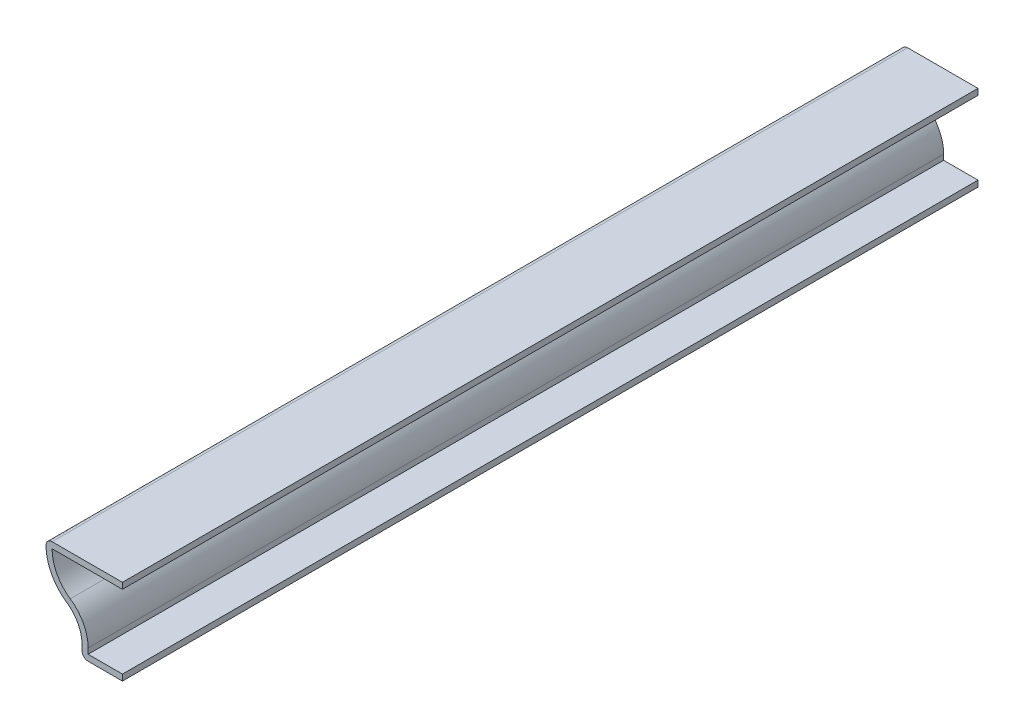
ISO-10303-21;
HEADER;
FILE_DESCRIPTION(('STEP AP214'),'2;1');
FILE_NAME('part.step','',(''),(''),'','','');
FILE_SCHEMA(('AUTOMOTIVE_DESIGN { 1 0 10303 214 1 1 1 1 }'));
ENDSEC;
DATA;
#1=APPLICATION_CONTEXT('core data for automotive mechanical design processes');
#2=APPLICATION_PROTOCOL_DEFINITION('international standard','automotive_design',2000,#1);
#3=PRODUCT_CONTEXT('',#1,'mechanical');
#4=PRODUCT('Part','Part','',(#3));
#5=PRODUCT_RELATED_PRODUCT_CATEGORY('part','',(#4));
#6=PRODUCT_DEFINITION_FORMATION('','',#4);
#7=PRODUCT_DEFINITION_CONTEXT('part definition',#1,'design');
#8=PRODUCT_DEFINITION('design','',#6,#7);
#9=PRODUCT_DEFINITION_SHAPE('','',#8);
#10=(LENGTH_UNIT() NAMED_UNIT(*) SI_UNIT(.MILLI.,.METRE.));
#11=(NAMED_UNIT(*) PLANE_ANGLE_UNIT() SI_UNIT($,.RADIAN.));
#12=(NAMED_UNIT(*) SI_UNIT($,.STERADIAN.) SOLID_ANGLE_UNIT());
#13=UNCERTAINTY_MEASURE_WITH_UNIT(LENGTH_MEASURE(1.E-05),#10,'distance_accuracy_value','');
#14=(GEOMETRIC_REPRESENTATION_CONTEXT(3) GLOBAL_UNCERTAINTY_ASSIGNED_CONTEXT((#13)) GLOBAL_UNIT_ASSIGNED_CONTEXT((#10,
#11,#12)) REPRESENTATION_CONTEXT('',''));
#15=CARTESIAN_POINT('',(0.,0.,0.));
#16=DIRECTION('',(0.,0.,1.));
#17=DIRECTION('',(1.,0.,0.));
#18=AXIS2_PLACEMENT_3D('',#15,#16,#17);
#19=CARTESIAN_POINT('',(-12.7,13.2715,-142.875));
#20=DIRECTION('',(0.,-1.,0.));
#21=DIRECTION('',(1.,0.,0.));
#22=AXIS2_PLACEMENT_3D('',#19,#20,#21);
#23=PLANE('',#22);
#24=DIRECTION('',(1.,0.,0.));
#25=VECTOR('',#24,1.);
#26=CARTESIAN_POINT('',(-12.7,13.2715,0.));
#27=LINE('',#26,#25);
#28=CARTESIAN_POINT('',(-11.7492925427489,13.2715,0.));
#29=VERTEX_POINT('',#28);
#30=CARTESIAN_POINT('',(0.,13.2715,0.));
#31=VERTEX_POINT('',#30);
#32=EDGE_CURVE('E188',#29,#31,#27,.T.);
#33=ORIENTED_EDGE('',*,*,#32,.F.);
#34=DIRECTION('',(0.,0.,1.));
#35=VECTOR('',#34,1.);
#36=CARTESIAN_POINT('',(-11.7492925427489,13.2715,-142.875));
#37=LINE('',#36,#35);
#38=CARTESIAN_POINT('',(-11.7492925427489,13.2715,-142.875));
#39=VERTEX_POINT('',#38);
#40=EDGE_CURVE('E160',#39,#29,#37,.T.);
#41=ORIENTED_EDGE('',*,*,#40,.F.);
#42=DIRECTION('',(1.,0.,0.));
#43=VECTOR('',#42,1.);
#44=CARTESIAN_POINT('',(-12.7,13.2715,-142.875));
#45=LINE('',#44,#43);
#46=CARTESIAN_POINT('',(0.,13.2715,-142.875));
#47=VERTEX_POINT('',#46);
#48=EDGE_CURVE('E141',#39,#47,#45,.T.);
#49=ORIENTED_EDGE('',*,*,#48,.T.);
#50=DIRECTION('',(0.,0.,1.));
#51=VECTOR('',#50,1.);
#52=CARTESIAN_POINT('',(0.,13.2715,-142.875));
#53=LINE('',#52,#51);
#54=EDGE_CURVE('E150',#47,#31,#53,.T.);
#55=ORIENTED_EDGE('',*,*,#54,.T.);
#56=EDGE_LOOP('',(#33,#41,#49,#55));
#57=FACE_BOUND('',#56,.T.);
#58=ADVANCED_FACE('F35',(#57),#23,.T.);
#59=CARTESIAN_POINT('',(-4.82779254274889,13.2715,-142.875));
#60=DIRECTION('',(0.,0.,1.));
#61=DIRECTION('',(1.,0.,0.));
#62=AXIS2_PLACEMENT_3D('',#59,#60,#61);
#63=CYLINDRICAL_SURFACE('',#62,6.9215);
#64=CARTESIAN_POINT('',(-4.82779254274889,13.2715,0.));
#65=DIRECTION('',(0.,0.,1.));
#66=DIRECTION('',(1.,0.,0.));
#67=AXIS2_PLACEMENT_3D('',#64,#65,#66);
#68=CIRCLE('',#67,6.9215);
#69=CARTESIAN_POINT('',(-8.71222072719505,7.54276716193884,0.));
#70=VERTEX_POINT('',#69);
#71=EDGE_CURVE('E161',#70,#29,#68,.F.);
#72=ORIENTED_EDGE('',*,*,#71,.F.);
#73=DIRECTION('',(0.,0.,1.));
#74=VECTOR('',#73,1.);
#75=CARTESIAN_POINT('',(-8.71222072719505,7.54276716193884,-142.875));
#76=LINE('',#75,#74);
#77=CARTESIAN_POINT('',(-8.71222072719505,7.54276716193884,-142.875));
#78=VERTEX_POINT('',#77);
#79=EDGE_CURVE('E214',#78,#70,#76,.T.);
#80=ORIENTED_EDGE('',*,*,#79,.F.);
#81=CARTESIAN_POINT('',(-4.82779254274889,13.2715,-142.875));
#82=DIRECTION('',(0.,0.,1.));
#83=DIRECTION('',(1.,0.,0.));
#84=AXIS2_PLACEMENT_3D('',#81,#82,#83);
#85=CIRCLE('',#84,6.9215);
#86=EDGE_CURVE('E158',#78,#39,#85,.F.);
#87=ORIENTED_EDGE('',*,*,#86,.T.);
#88=ORIENTED_EDGE('',*,*,#40,.T.);
#89=EDGE_LOOP('',(#72,#80,#87,#88));
#90=FACE_BOUND('',#89,.T.);
#91=ADVANCED_FACE('F272',(#90),#63,.F.);
#92=CARTESIAN_POINT('',(-12.525375,1.9191486878788,-142.875));
#93=DIRECTION('',(0.,0.,1.));
#94=DIRECTION('',(1.,0.,0.));
#95=AXIS2_PLACEMENT_3D('',#92,#93,#94);
#96=CYLINDRICAL_SURFACE('',#95,6.7945);
#97=CARTESIAN_POINT('',(-12.525375,1.9191486878788,0.));
#98=DIRECTION('',(0.,0.,1.));
#99=DIRECTION('',(1.,0.,0.));
#100=AXIS2_PLACEMENT_3D('',#97,#98,#99);
#101=CIRCLE('',#100,6.7945);
#102=CARTESIAN_POINT('',(-5.730875,1.9191486878788,0.));
#103=VERTEX_POINT('',#102);
#104=EDGE_CURVE('E164',#103,#70,#101,.T.);
#105=ORIENTED_EDGE('',*,*,#104,.F.);
#106=DIRECTION('',(0.,0.,1.));
#107=VECTOR('',#106,1.);
#108=CARTESIAN_POINT('',(-5.730875,1.9191486878788,-142.875));
#109=LINE('',#108,#107);
#110=CARTESIAN_POINT('',(-5.730875,1.9191486878788,-142.875));
#111=VERTEX_POINT('',#110);
#112=EDGE_CURVE('E216',#111,#103,#109,.T.);
#113=ORIENTED_EDGE('',*,*,#112,.F.);
#114=CARTESIAN_POINT('',(-12.525375,1.9191486878788,-142.875));
#115=DIRECTION('',(0.,0.,1.));
#116=DIRECTION('',(1.,0.,0.));
#117=AXIS2_PLACEMENT_3D('',#114,#115,#116);
#118=CIRCLE('',#117,6.7945);
#119=EDGE_CURVE('E184',#111,#78,#118,.T.);
#120=ORIENTED_EDGE('',*,*,#119,.T.);
#121=ORIENTED_EDGE('',*,*,#79,.T.);
#122=EDGE_LOOP('',(#105,#113,#120,#121));
#123=FACE_BOUND('',#122,.T.);
#124=ADVANCED_FACE('F302',(#123),#96,.T.);
#125=CARTESIAN_POINT('',(-5.730875,0.,-142.875));
#126=DIRECTION('',(1.,0.,0.));
#127=DIRECTION('',(0.,0.,-1.));
#128=AXIS2_PLACEMENT_3D('',#125,#126,#127);
#129=PLANE('',#128);
#130=DIRECTION('',(0.,1.,0.));
#131=VECTOR('',#130,1.);
#132=CARTESIAN_POINT('',(-5.730875,0.,0.));
#133=LINE('',#132,#131);
#134=CARTESIAN_POINT('',(-5.730875,1.016,0.));
#135=VERTEX_POINT('',#134);
#136=EDGE_CURVE('E207',#135,#103,#133,.T.);
#137=ORIENTED_EDGE('',*,*,#136,.F.);
#138=DIRECTION('',(0.,0.,1.));
#139=VECTOR('',#138,1.);
#140=CARTESIAN_POINT('',(-5.730875,1.016,-142.875));
#141=LINE('',#140,#139);
#142=CARTESIAN_POINT('',(-5.730875,1.016,-142.875));
#143=VERTEX_POINT('',#142);
#144=EDGE_CURVE('E218',#143,#135,#141,.T.);
#145=ORIENTED_EDGE('',*,*,#144,.F.);
#146=DIRECTION('',(0.,1.,0.));
#147=VECTOR('',#146,1.);
#148=CARTESIAN_POINT('',(-5.730875,0.,-142.875));
#149=LINE('',#148,#147);
#150=EDGE_CURVE('E181',#143,#111,#149,.T.);
#151=ORIENTED_EDGE('',*,*,#150,.T.);
#152=ORIENTED_EDGE('',*,*,#112,.T.);
#153=EDGE_LOOP('',(#137,#145,#151,#152));
#154=FACE_BOUND('',#153,.T.);
#155=ADVANCED_FACE('F279',(#154),#129,.T.);
#156=CARTESIAN_POINT('',(0.,1.016,-142.875));
#157=DIRECTION('',(0.,1.,0.));
#158=DIRECTION('',(-1.,0.,0.));
#159=AXIS2_PLACEMENT_3D('',#156,#157,#158);
#160=PLANE('',#159);
#161=DIRECTION('',(-1.,0.,0.));
#162=VECTOR('',#161,1.);
#163=CARTESIAN_POINT('',(0.,1.016,0.));
#164=LINE('',#163,#162);
#165=CARTESIAN_POINT('',(0.,1.016,0.));
#166=VERTEX_POINT('',#165);
#167=EDGE_CURVE('E204',#166,#135,#164,.T.);
#168=ORIENTED_EDGE('',*,*,#167,.F.);
#169=DIRECTION('',(0.,0.,1.));
#170=VECTOR('',#169,1.);
#171=CARTESIAN_POINT('',(0.,1.016,-142.875));
#172=LINE('',#171,#170);
#173=CARTESIAN_POINT('',(0.,1.016,-142.875));
#174=VERTEX_POINT('',#173);
#175=EDGE_CURVE('E220',#174,#166,#172,.T.);
#176=ORIENTED_EDGE('',*,*,#175,.F.);
#177=DIRECTION('',(-1.,0.,0.));
#178=VECTOR('',#177,1.);
#179=CARTESIAN_POINT('',(0.,1.016,-142.875));
#180=LINE('',#179,#178);
#181=EDGE_CURVE('E178',#174,#143,#180,.T.);
#182=ORIENTED_EDGE('',*,*,#181,.T.);
#183=ORIENTED_EDGE('',*,*,#144,.T.);
#184=EDGE_LOOP('',(#168,#176,#182,#183));
#185=FACE_BOUND('',#184,.T.);
#186=ADVANCED_FACE('F282',(#185),#160,.T.);
#187=CARTESIAN_POINT('',(0.,1.016,-142.875));
#188=DIRECTION('',(-1.,0.,0.));
#189=DIRECTION('',(0.,-1.,0.));
#190=AXIS2_PLACEMENT_3D('',#187,#188,#189);
#191=PLANE('',#190);
#192=DIRECTION('',(0.,-1.,0.));
#193=VECTOR('',#192,1.);
#194=CARTESIAN_POINT('',(0.,1.016,0.));
#195=LINE('',#194,#193);
#196=CARTESIAN_POINT('',(0.,0.,0.));
#197=VERTEX_POINT('',#196);
#198=EDGE_CURVE('E202',#166,#197,#195,.T.);
#199=ORIENTED_EDGE('',*,*,#198,.T.);
#200=DIRECTION('',(0.,0.,1.));
#201=VECTOR('',#200,1.);
#202=CARTESIAN_POINT('',(0.,0.,-142.875));
#203=LINE('',#202,#201);
#204=CARTESIAN_POINT('',(0.,0.,-142.875));
#205=VERTEX_POINT('',#204);
#206=EDGE_CURVE('E222',#205,#197,#203,.T.);
#207=ORIENTED_EDGE('',*,*,#206,.F.);
#208=DIRECTION('',(0.,-1.,0.));
#209=VECTOR('',#208,1.);
#210=CARTESIAN_POINT('',(0.,1.016,-142.875));
#211=LINE('',#210,#209);
#212=EDGE_CURVE('E176',#174,#205,#211,.T.);
#213=ORIENTED_EDGE('',*,*,#212,.F.);
#214=ORIENTED_EDGE('',*,*,#175,.T.);
#215=EDGE_LOOP('',(#199,#207,#213,#214));
#216=FACE_BOUND('',#215,.T.);
#217=ADVANCED_FACE('F286',(#216),#191,.F.);
#218=CARTESIAN_POINT('',(0.,0.,-142.875));
#219=DIRECTION('',(0.,1.,0.));
#220=DIRECTION('',(-1.,0.,0.));
#221=AXIS2_PLACEMENT_3D('',#218,#219,#220);
#222=PLANE('',#221);
#223=DIRECTION('',(-1.,0.,0.));
#224=VECTOR('',#223,1.);
#225=CARTESIAN_POINT('',(0.,0.,0.));
#226=LINE('',#225,#224);
#227=CARTESIAN_POINT('',(-5.730875,0.,0.));
#228=VERTEX_POINT('',#227);
#229=EDGE_CURVE('E200',#197,#228,#226,.T.);
#230=ORIENTED_EDGE('',*,*,#229,.T.);
#231=DIRECTION('',(0.,0.,1.));
#232=VECTOR('',#231,1.);
#233=CARTESIAN_POINT('',(-5.730875,0.,-142.875));
#234=LINE('',#233,#232);
#235=CARTESIAN_POINT('',(-5.730875,0.,-142.875));
#236=VERTEX_POINT('',#235);
#237=EDGE_CURVE('E11',#228,#236,#234,.F.);
#238=ORIENTED_EDGE('',*,*,#237,.T.);
#239=DIRECTION('',(-1.,0.,0.));
#240=VECTOR('',#239,1.);
#241=CARTESIAN_POINT('',(0.,0.,-142.875));
#242=LINE('',#241,#240);
#243=EDGE_CURVE('E174',#205,#236,#242,.T.);
#244=ORIENTED_EDGE('',*,*,#243,.F.);
#245=ORIENTED_EDGE('',*,*,#206,.T.);
#246=EDGE_LOOP('',(#230,#238,#244,#245));
#247=FACE_BOUND('',#246,.T.);
#248=ADVANCED_FACE('F288',(#247),#222,.F.);
#249=CARTESIAN_POINT('',(-6.746875,0.,-142.875));
#250=DIRECTION('',(1.,0.,0.));
#251=DIRECTION('',(0.,0.,-1.));
#252=AXIS2_PLACEMENT_3D('',#249,#250,#251);
#253=PLANE('',#252);
#254=DIRECTION('',(0.,1.,0.));
#255=VECTOR('',#254,1.);
#256=CARTESIAN_POINT('',(-6.746875,0.,-142.875));
#257=LINE('',#256,#255);
#258=CARTESIAN_POINT('',(-6.746875,1.016,-142.875));
#259=VERTEX_POINT('',#258);
#260=CARTESIAN_POINT('',(-6.746875,1.9191486878788,-142.875));
#261=VERTEX_POINT('',#260);
#262=EDGE_CURVE('E172',#259,#261,#257,.T.);
#263=ORIENTED_EDGE('',*,*,#262,.F.);
#264=DIRECTION('',(0.,0.,1.));
#265=VECTOR('',#264,1.);
#266=CARTESIAN_POINT('',(-6.746875,1.016,-142.875));
#267=LINE('',#266,#265);
#268=CARTESIAN_POINT('',(-6.746875,1.016,0.));
#269=VERTEX_POINT('',#268);
#270=EDGE_CURVE('E43',#259,#269,#267,.T.);
#271=ORIENTED_EDGE('',*,*,#270,.T.);
#272=DIRECTION('',(0.,1.,0.));
#273=VECTOR('',#272,1.);
#274=CARTESIAN_POINT('',(-6.746875,0.,0.));
#275=LINE('',#274,#273);
#276=CARTESIAN_POINT('',(-6.746875,1.9191486878788,0.));
#277=VERTEX_POINT('',#276);
#278=EDGE_CURVE('E198',#269,#277,#275,.T.);
#279=ORIENTED_EDGE('',*,*,#278,.T.);
#280=DIRECTION('',(0.,0.,1.));
#281=VECTOR('',#280,1.);
#282=CARTESIAN_POINT('',(-6.746875,1.9191486878788,-142.875));
#283=LINE('',#282,#281);
#284=EDGE_CURVE('E225',#261,#277,#283,.T.);
#285=ORIENTED_EDGE('',*,*,#284,.F.);
#286=EDGE_LOOP('',(#263,#271,#279,#285));
#287=FACE_BOUND('',#286,.T.);
#288=ADVANCED_FACE('F246',(#287),#253,.F.);
#289=CARTESIAN_POINT('',(-12.525375,1.9191486878788,-142.875));
#290=DIRECTION('',(0.,0.,1.));
#291=DIRECTION('',(1.,0.,0.));
#292=AXIS2_PLACEMENT_3D('',#289,#290,#291);
#293=CYLINDRICAL_SURFACE('',#292,5.7785);
#294=CARTESIAN_POINT('',(-12.525375,1.9191486878788,0.));
#295=DIRECTION('',(0.,0.,1.));
#296=DIRECTION('',(1.,0.,0.));
#297=AXIS2_PLACEMENT_3D('',#294,#295,#296);
#298=CIRCLE('',#297,5.7785);
#299=CARTESIAN_POINT('',(-9.28241202032476,6.70185224992986,0.));
#300=VERTEX_POINT('',#299);
#301=EDGE_CURVE('E196',#277,#300,#298,.T.);
#302=ORIENTED_EDGE('',*,*,#301,.T.);
#303=DIRECTION('',(0.,0.,1.));
#304=VECTOR('',#303,1.);
#305=CARTESIAN_POINT('',(-9.28241202032476,6.70185224992986,-142.875));
#306=LINE('',#305,#304);
#307=CARTESIAN_POINT('',(-9.28241202032476,6.70185224992986,-142.875));
#308=VERTEX_POINT('',#307);
#309=EDGE_CURVE('E228',#308,#300,#306,.T.);
#310=ORIENTED_EDGE('',*,*,#309,.F.);
#311=CARTESIAN_POINT('',(-12.525375,1.9191486878788,-142.875));
#312=DIRECTION('',(0.,0.,1.));
#313=DIRECTION('',(1.,0.,0.));
#314=AXIS2_PLACEMENT_3D('',#311,#312,#313);
#315=CIRCLE('',#314,5.7785);
#316=EDGE_CURVE('E170',#261,#308,#315,.T.);
#317=ORIENTED_EDGE('',*,*,#316,.F.);
#318=ORIENTED_EDGE('',*,*,#284,.T.);
#319=EDGE_LOOP('',(#302,#310,#317,#318));
#320=FACE_BOUND('',#319,.T.);
#321=ADVANCED_FACE('F257',(#320),#293,.F.);
#322=CARTESIAN_POINT('',(-4.82779254274889,13.2715,-142.875));
#323=DIRECTION('',(0.,0.,1.));
#324=DIRECTION('',(1.,0.,0.));
#325=AXIS2_PLACEMENT_3D('',#322,#323,#324);
#326=CYLINDRICAL_SURFACE('',#325,7.9375);
#327=CARTESIAN_POINT('',(-4.82779254274889,13.2715,0.));
#328=DIRECTION('',(0.,0.,-1.));
#329=DIRECTION('',(-1.,0.,0.));
#330=AXIS2_PLACEMENT_3D('',#327,#328,#329);
#331=CIRCLE('',#330,7.9375);
#332=CARTESIAN_POINT('',(-12.7652925427489,13.2715,0.));
#333=VERTEX_POINT('',#332);
#334=EDGE_CURVE('E193',#300,#333,#331,.T.);
#335=ORIENTED_EDGE('',*,*,#334,.T.);
#336=DIRECTION('',(0.,0.,1.));
#337=VECTOR('',#336,1.);
#338=CARTESIAN_POINT('',(-12.7652925427489,13.2715,-142.875));
#339=LINE('',#338,#337);
#340=CARTESIAN_POINT('',(-12.7652925427489,13.2715,-142.875));
#341=VERTEX_POINT('',#340);
#342=EDGE_CURVE('E238',#333,#341,#339,.F.);
#343=ORIENTED_EDGE('',*,*,#342,.T.);
#344=CARTESIAN_POINT('',(-4.82779254274889,13.2715,-142.875));
#345=DIRECTION('',(0.,0.,-1.));
#346=DIRECTION('',(-1.,0.,0.));
#347=AXIS2_PLACEMENT_3D('',#344,#345,#346);
#348=CIRCLE('',#347,7.9375);
#349=EDGE_CURVE('E168',#308,#341,#348,.T.);
#350=ORIENTED_EDGE('',*,*,#349,.F.);
#351=ORIENTED_EDGE('',*,*,#309,.T.);
#352=EDGE_LOOP('',(#335,#343,#350,#351));
#353=FACE_BOUND('',#352,.T.);
#354=ADVANCED_FACE('F261',(#353),#326,.T.);
#355=CARTESIAN_POINT('',(-12.7,14.2875,-142.875));
#356=DIRECTION('',(0.,-1.,0.));
#357=DIRECTION('',(1.,0.,0.));
#358=AXIS2_PLACEMENT_3D('',#355,#356,#357);
#359=PLANE('',#358);
#360=DIRECTION('',(1.,0.,0.));
#361=VECTOR('',#360,1.);
#362=CARTESIAN_POINT('',(-12.7,14.2875,-142.875));
#363=LINE('',#362,#361);
#364=CARTESIAN_POINT('',(-11.7492925427489,14.2875,-142.875));
#365=VERTEX_POINT('',#364);
#366=CARTESIAN_POINT('',(0.,14.2875,-142.875));
#367=VERTEX_POINT('',#366);
#368=EDGE_CURVE('E144',#365,#367,#363,.T.);
#369=ORIENTED_EDGE('',*,*,#368,.F.);
#370=DIRECTION('',(0.,0.,1.));
#371=VECTOR('',#370,1.);
#372=CARTESIAN_POINT('',(-11.7492925427489,14.2875,-142.875));
#373=LINE('',#372,#371);
#374=CARTESIAN_POINT('',(-11.7492925427489,14.2875,0.));
#375=VERTEX_POINT('',#374);
#376=EDGE_CURVE('E213',#365,#375,#373,.T.);
#377=ORIENTED_EDGE('',*,*,#376,.T.);
#378=DIRECTION('',(1.,0.,0.));
#379=VECTOR('',#378,1.);
#380=CARTESIAN_POINT('',(-12.7,14.2875,0.));
#381=LINE('',#380,#379);
#382=CARTESIAN_POINT('',(0.,14.2875,0.));
#383=VERTEX_POINT('',#382);
#384=EDGE_CURVE('E191',#375,#383,#381,.T.);
#385=ORIENTED_EDGE('',*,*,#384,.T.);
#386=DIRECTION('',(0.,0.,1.));
#387=VECTOR('',#386,1.);
#388=CARTESIAN_POINT('',(0.,14.2875,-142.875));
#389=LINE('',#388,#387);
#390=EDGE_CURVE('E157',#367,#383,#389,.T.);
#391=ORIENTED_EDGE('',*,*,#390,.F.);
#392=EDGE_LOOP('',(#369,#377,#385,#391));
#393=FACE_BOUND('',#392,.T.);
#394=ADVANCED_FACE('F268',(#393),#359,.F.);
#395=CARTESIAN_POINT('',(0.,14.2875,-142.875));
#396=DIRECTION('',(-1.,0.,0.));
#397=DIRECTION('',(0.,-1.,0.));
#398=AXIS2_PLACEMENT_3D('',#395,#396,#397);
#399=PLANE('',#398);
#400=DIRECTION('',(0.,-1.,0.));
#401=VECTOR('',#400,1.);
#402=CARTESIAN_POINT('',(0.,14.2875,0.));
#403=LINE('',#402,#401);
#404=EDGE_CURVE('E153',#383,#31,#403,.T.);
#405=ORIENTED_EDGE('',*,*,#404,.T.);
#406=ORIENTED_EDGE('',*,*,#54,.F.);
#407=DIRECTION('',(0.,-1.,0.));
#408=VECTOR('',#407,1.);
#409=CARTESIAN_POINT('',(0.,14.2875,-142.875));
#410=LINE('',#409,#408);
#411=EDGE_CURVE('E135',#367,#47,#410,.T.);
#412=ORIENTED_EDGE('',*,*,#411,.F.);
#413=ORIENTED_EDGE('',*,*,#390,.T.);
#414=EDGE_LOOP('',(#405,#406,#412,#413));
#415=FACE_BOUND('',#414,.T.);
#416=ADVANCED_FACE('F151',(#415),#399,.F.);
#417=CARTESIAN_POINT('',(-4.82779254274889,13.2715,-142.875));
#418=DIRECTION('',(0.,0.,-1.));
#419=DIRECTION('',(-1.,0.,0.));
#420=AXIS2_PLACEMENT_3D('',#417,#418,#419);
#421=PLANE('',#420);
#422=ORIENTED_EDGE('',*,*,#349,.T.);
#423=CARTESIAN_POINT('',(-11.7492925427489,13.2715,-142.875));
#424=DIRECTION('',(0.,0.,-1.));
#425=DIRECTION('',(-1.,0.,0.));
#426=AXIS2_PLACEMENT_3D('',#423,#424,#425);
#427=CIRCLE('',#426,1.016);
#428=EDGE_CURVE('E241',#341,#365,#427,.T.);
#429=ORIENTED_EDGE('',*,*,#428,.T.);
#430=ORIENTED_EDGE('',*,*,#368,.T.);
#431=ORIENTED_EDGE('',*,*,#411,.T.);
#432=ORIENTED_EDGE('',*,*,#48,.F.);
#433=ORIENTED_EDGE('',*,*,#86,.F.);
#434=ORIENTED_EDGE('',*,*,#119,.F.);
#435=ORIENTED_EDGE('',*,*,#150,.F.);
#436=ORIENTED_EDGE('',*,*,#181,.F.);
#437=ORIENTED_EDGE('',*,*,#212,.T.);
#438=ORIENTED_EDGE('',*,*,#243,.T.);
#439=CARTESIAN_POINT('',(-5.730875,1.016,-142.875));
#440=DIRECTION('',(0.,0.,-1.));
#441=DIRECTION('',(-1.,0.,0.));
#442=AXIS2_PLACEMENT_3D('',#439,#440,#441);
#443=CIRCLE('',#442,1.016);
#444=EDGE_CURVE('E50',#236,#259,#443,.T.);
#445=ORIENTED_EDGE('',*,*,#444,.T.);
#446=ORIENTED_EDGE('',*,*,#262,.T.);
#447=ORIENTED_EDGE('',*,*,#316,.T.);
#448=EDGE_LOOP('',(#422,#429,#430,#431,#432,#433,#434,#435,#436,#437,#438,#445,#446,#447));
#449=FACE_BOUND('',#448,.T.);
#450=ADVANCED_FACE('F138',(#449),#421,.T.);
#451=CARTESIAN_POINT('',(-4.82779254274889,13.2715,0.));
#452=DIRECTION('',(0.,0.,-1.));
#453=DIRECTION('',(-1.,0.,0.));
#454=AXIS2_PLACEMENT_3D('',#451,#452,#453);
#455=PLANE('',#454);
#456=ORIENTED_EDGE('',*,*,#384,.F.);
#457=CARTESIAN_POINT('',(-11.7492925427489,13.2715,0.));
#458=DIRECTION('',(0.,0.,-1.));
#459=DIRECTION('',(-1.,0.,0.));
#460=AXIS2_PLACEMENT_3D('',#457,#458,#459);
#461=CIRCLE('',#460,1.016);
#462=EDGE_CURVE('E236',#375,#333,#461,.F.);
#463=ORIENTED_EDGE('',*,*,#462,.T.);
#464=ORIENTED_EDGE('',*,*,#334,.F.);
#465=ORIENTED_EDGE('',*,*,#301,.F.);
#466=ORIENTED_EDGE('',*,*,#278,.F.);
#467=CARTESIAN_POINT('',(-5.730875,1.016,0.));
#468=DIRECTION('',(0.,0.,-1.));
#469=DIRECTION('',(-1.,0.,0.));
#470=AXIS2_PLACEMENT_3D('',#467,#468,#469);
#471=CIRCLE('',#470,1.016);
#472=EDGE_CURVE('E234',#269,#228,#471,.F.);
#473=ORIENTED_EDGE('',*,*,#472,.T.);
#474=ORIENTED_EDGE('',*,*,#229,.F.);
#475=ORIENTED_EDGE('',*,*,#198,.F.);
#476=ORIENTED_EDGE('',*,*,#167,.T.);
#477=ORIENTED_EDGE('',*,*,#136,.T.);
#478=ORIENTED_EDGE('',*,*,#104,.T.);
#479=ORIENTED_EDGE('',*,*,#71,.T.);
#480=ORIENTED_EDGE('',*,*,#32,.T.);
#481=ORIENTED_EDGE('',*,*,#404,.F.);
#482=EDGE_LOOP('',(#456,#463,#464,#465,#466,#473,#474,#475,#476,#477,#478,#479,#480,#481));
#483=FACE_BOUND('',#482,.T.);
#484=ADVANCED_FACE('F252',(#483),#455,.F.);
#485=CARTESIAN_POINT('',(-11.7492925427489,13.2715,-142.875));
#486=DIRECTION('',(0.,0.,1.));
#487=DIRECTION('',(1.,0.,0.));
#488=AXIS2_PLACEMENT_3D('',#485,#486,#487);
#489=CYLINDRICAL_SURFACE('',#488,1.016);
#490=ORIENTED_EDGE('',*,*,#428,.F.);
#491=ORIENTED_EDGE('',*,*,#342,.F.);
#492=ORIENTED_EDGE('',*,*,#462,.F.);
#493=ORIENTED_EDGE('',*,*,#376,.F.);
#494=EDGE_LOOP('',(#490,#491,#492,#493));
#495=FACE_BOUND('',#494,.T.);
#496=ADVANCED_FACE('F266',(#495),#489,.T.);
#497=CARTESIAN_POINT('',(-5.730875,1.016,-142.875));
#498=DIRECTION('',(0.,0.,1.));
#499=DIRECTION('',(1.,0.,0.));
#500=AXIS2_PLACEMENT_3D('',#497,#498,#499);
#501=CYLINDRICAL_SURFACE('',#500,1.016);
#502=ORIENTED_EDGE('',*,*,#444,.F.);
#503=ORIENTED_EDGE('',*,*,#237,.F.);
#504=ORIENTED_EDGE('',*,*,#472,.F.);
#505=ORIENTED_EDGE('',*,*,#270,.F.);
#506=EDGE_LOOP('',(#502,#503,#504,#505));
#507=FACE_BOUND('',#506,.T.);
#508=ADVANCED_FACE('F37',(#507),#501,.T.);
#509=CLOSED_SHELL('',(#58,#91,#124,#155,#186,#217,#248,#288,#321,#354,#394,#416,#450,#484,#496,#508));
#510=MANIFOLD_SOLID_BREP('B2',#509);
#511=ADVANCED_BREP_SHAPE_REPRESENTATION('',(#18,#510),#14);
#512=SHAPE_DEFINITION_REPRESENTATION(#9,#511);
ENDSEC;
END-ISO-10303-21;
